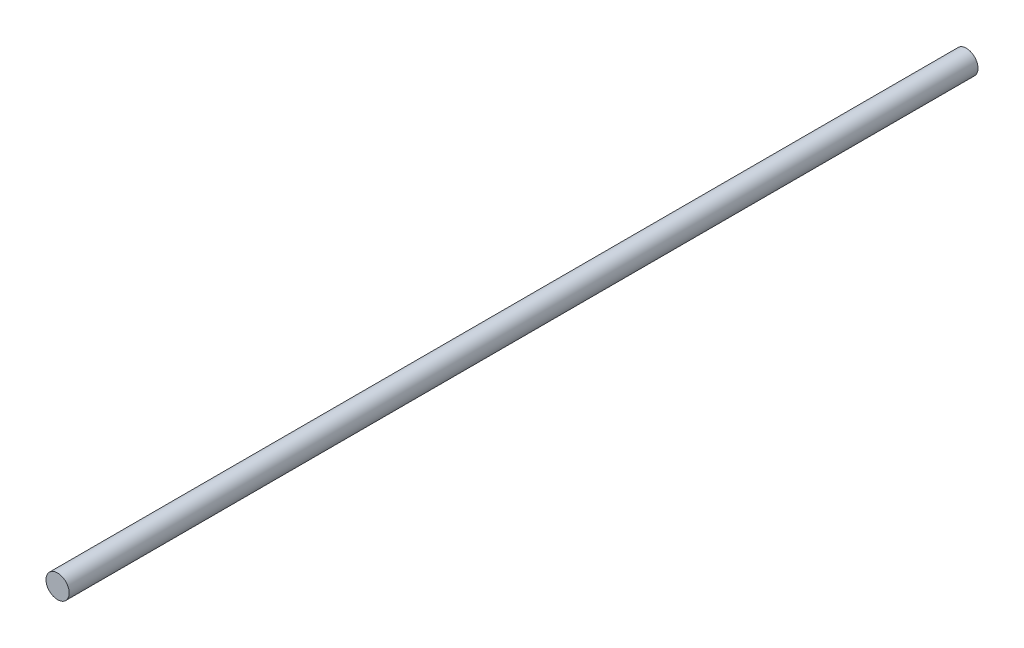
ISO-10303-21;
HEADER;
FILE_DESCRIPTION(('STEP AP214'),'2;1');
FILE_NAME('part.step','',(''),(''),'','','');
FILE_SCHEMA(('AUTOMOTIVE_DESIGN { 1 0 10303 214 1 1 1 1 }'));
ENDSEC;
DATA;
#1=APPLICATION_CONTEXT('core data for automotive mechanical design processes');
#2=APPLICATION_PROTOCOL_DEFINITION('international standard','automotive_design',2000,#1);
#3=PRODUCT_CONTEXT('',#1,'mechanical');
#4=PRODUCT('Part','Part','',(#3));
#5=PRODUCT_RELATED_PRODUCT_CATEGORY('part','',(#4));
#6=PRODUCT_DEFINITION_FORMATION('','',#4);
#7=PRODUCT_DEFINITION_CONTEXT('part definition',#1,'design');
#8=PRODUCT_DEFINITION('design','',#6,#7);
#9=PRODUCT_DEFINITION_SHAPE('','',#8);
#10=(LENGTH_UNIT() NAMED_UNIT(*) SI_UNIT(.MILLI.,.METRE.));
#11=(NAMED_UNIT(*) PLANE_ANGLE_UNIT() SI_UNIT($,.RADIAN.));
#12=(NAMED_UNIT(*) SI_UNIT($,.STERADIAN.) SOLID_ANGLE_UNIT());
#13=UNCERTAINTY_MEASURE_WITH_UNIT(LENGTH_MEASURE(1.E-05),#10,'distance_accuracy_value','');
#14=(GEOMETRIC_REPRESENTATION_CONTEXT(3) GLOBAL_UNCERTAINTY_ASSIGNED_CONTEXT((#13)) GLOBAL_UNIT_ASSIGNED_CONTEXT((#10,
#11,#12)) REPRESENTATION_CONTEXT('',''));
#15=CARTESIAN_POINT('',(0.,0.,0.));
#16=DIRECTION('',(0.,0.,1.));
#17=DIRECTION('',(1.,0.,0.));
#18=AXIS2_PLACEMENT_3D('',#15,#16,#17);
#19=CARTESIAN_POINT('',(0.,0.,235.));
#20=DIRECTION('',(0.,0.,-1.));
#21=DIRECTION('',(-1.,0.,0.));
#22=AXIS2_PLACEMENT_3D('',#19,#20,#21);
#23=CYLINDRICAL_SURFACE('',#22,3.);
#24=CARTESIAN_POINT('',(0.,0.,235.));
#25=DIRECTION('',(0.,0.,1.));
#26=DIRECTION('',(1.,0.,0.));
#27=AXIS2_PLACEMENT_3D('',#24,#25,#26);
#28=CIRCLE('',#27,3.);
#29=CARTESIAN_POINT('',(3.,0.,235.));
#30=VERTEX_POINT('',#29);
#31=EDGE_CURVE('E10',#30,#30,#28,.T.);
#32=ORIENTED_EDGE('',*,*,#31,.F.);
#33=EDGE_LOOP('',(#32));
#34=FACE_BOUND('',#33,.T.);
#35=CARTESIAN_POINT('',(0.,0.,0.));
#36=DIRECTION('',(0.,0.,1.));
#37=DIRECTION('',(1.,0.,0.));
#38=AXIS2_PLACEMENT_3D('',#35,#36,#37);
#39=CIRCLE('',#38,3.);
#40=CARTESIAN_POINT('',(3.,0.,0.));
#41=VERTEX_POINT('',#40);
#42=EDGE_CURVE('E32',#41,#41,#39,.T.);
#43=ORIENTED_EDGE('',*,*,#42,.T.);
#44=EDGE_LOOP('',(#43));
#45=FACE_BOUND('',#44,.T.);
#46=ADVANCED_FACE('F29',(#34,#45),#23,.T.);
#47=CARTESIAN_POINT('',(0.,0.,235.));
#48=DIRECTION('',(0.,0.,1.));
#49=DIRECTION('',(1.,0.,0.));
#50=AXIS2_PLACEMENT_3D('',#47,#48,#49);
#51=PLANE('',#50);
#52=ORIENTED_EDGE('',*,*,#31,.T.);
#53=EDGE_LOOP('',(#52));
#54=FACE_BOUND('',#53,.T.);
#55=ADVANCED_FACE('F44',(#54),#51,.T.);
#56=CARTESIAN_POINT('',(0.,0.,0.));
#57=DIRECTION('',(0.,0.,1.));
#58=DIRECTION('',(1.,0.,0.));
#59=AXIS2_PLACEMENT_3D('',#56,#57,#58);
#60=PLANE('',#59);
#61=ORIENTED_EDGE('',*,*,#42,.F.);
#62=EDGE_LOOP('',(#61));
#63=FACE_BOUND('',#62,.T.);
#64=ADVANCED_FACE('F42',(#63),#60,.F.);
#65=CLOSED_SHELL('',(#46,#55,#64));
#66=MANIFOLD_SOLID_BREP('B2',#65);
#67=ADVANCED_BREP_SHAPE_REPRESENTATION('',(#18,#66),#14);
#68=SHAPE_DEFINITION_REPRESENTATION(#9,#67);
ENDSEC;
END-ISO-10303-21;
